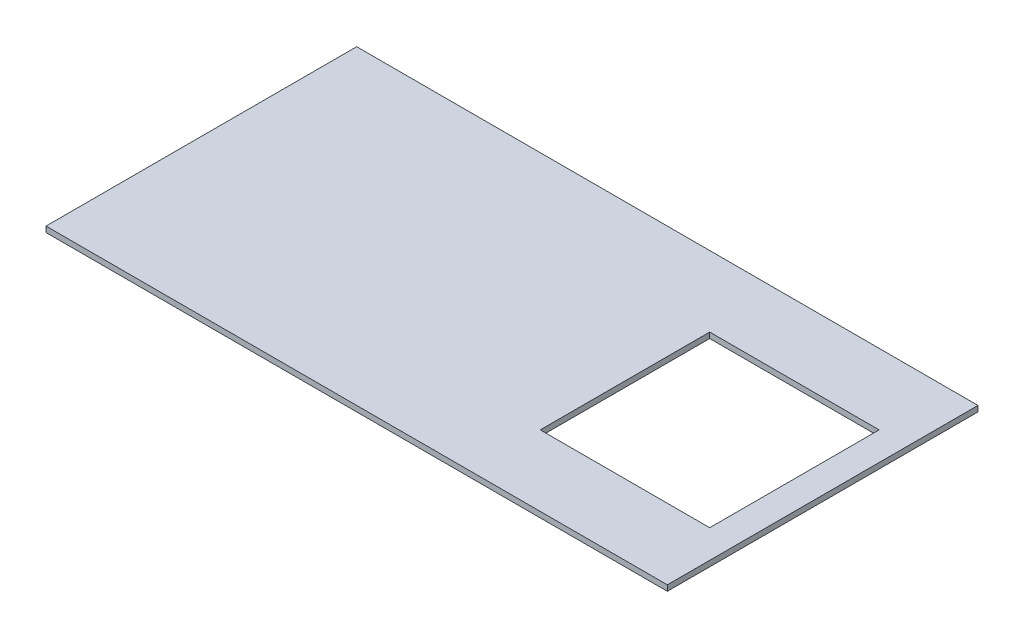
ISO-10303-21;
HEADER;
FILE_DESCRIPTION(('STEP AP214'),'2;1');
FILE_NAME('part.step','',(''),(''),'','','');
FILE_SCHEMA(('AUTOMOTIVE_DESIGN { 1 0 10303 214 1 1 1 1 }'));
ENDSEC;
DATA;
#1=APPLICATION_CONTEXT('core data for automotive mechanical design processes');
#2=APPLICATION_PROTOCOL_DEFINITION('international standard','automotive_design',2000,#1);
#3=PRODUCT_CONTEXT('',#1,'mechanical');
#4=PRODUCT('Part','Part','',(#3));
#5=PRODUCT_RELATED_PRODUCT_CATEGORY('part','',(#4));
#6=PRODUCT_DEFINITION_FORMATION('','',#4);
#7=PRODUCT_DEFINITION_CONTEXT('part definition',#1,'design');
#8=PRODUCT_DEFINITION('design','',#6,#7);
#9=PRODUCT_DEFINITION_SHAPE('','',#8);
#10=(LENGTH_UNIT() NAMED_UNIT(*) SI_UNIT(.MILLI.,.METRE.));
#11=(NAMED_UNIT(*) PLANE_ANGLE_UNIT() SI_UNIT($,.RADIAN.));
#12=(NAMED_UNIT(*) SI_UNIT($,.STERADIAN.) SOLID_ANGLE_UNIT());
#13=UNCERTAINTY_MEASURE_WITH_UNIT(LENGTH_MEASURE(1.E-05),#10,'distance_accuracy_value','');
#14=(GEOMETRIC_REPRESENTATION_CONTEXT(3) GLOBAL_UNCERTAINTY_ASSIGNED_CONTEXT((#13)) GLOBAL_UNIT_ASSIGNED_CONTEXT((#10,
#11,#12)) REPRESENTATION_CONTEXT('',''));
#15=CARTESIAN_POINT('',(0.,0.,0.));
#16=DIRECTION('',(0.,0.,1.));
#17=DIRECTION('',(1.,0.,0.));
#18=AXIS2_PLACEMENT_3D('',#15,#16,#17);
#19=CARTESIAN_POINT('',(0.,20.,0.));
#20=DIRECTION('',(1.,0.,0.));
#21=DIRECTION('',(0.,0.,-1.));
#22=AXIS2_PLACEMENT_3D('',#19,#20,#21);
#23=PLANE('',#22);
#24=DIRECTION('',(0.,0.,1.));
#25=VECTOR('',#24,1.);
#26=CARTESIAN_POINT('',(0.,0.,0.));
#27=LINE('',#26,#25);
#28=CARTESIAN_POINT('',(0.,0.,-1100.));
#29=VERTEX_POINT('',#28);
#30=CARTESIAN_POINT('',(0.,0.,0.));
#31=VERTEX_POINT('',#30);
#32=EDGE_CURVE('E128',#29,#31,#27,.T.);
#33=ORIENTED_EDGE('',*,*,#32,.T.);
#34=DIRECTION('',(0.,-1.,0.));
#35=VECTOR('',#34,1.);
#36=CARTESIAN_POINT('',(0.,20.,0.));
#37=LINE('',#36,#35);
#38=CARTESIAN_POINT('',(0.,20.,0.));
#39=VERTEX_POINT('',#38);
#40=EDGE_CURVE('E11',#39,#31,#37,.T.);
#41=ORIENTED_EDGE('',*,*,#40,.F.);
#42=DIRECTION('',(0.,0.,1.));
#43=VECTOR('',#42,1.);
#44=CARTESIAN_POINT('',(0.,20.,0.));
#45=LINE('',#44,#43);
#46=CARTESIAN_POINT('',(0.,20.,-1100.));
#47=VERTEX_POINT('',#46);
#48=EDGE_CURVE('E139',#47,#39,#45,.T.);
#49=ORIENTED_EDGE('',*,*,#48,.F.);
#50=DIRECTION('',(0.,-1.,0.));
#51=VECTOR('',#50,1.);
#52=CARTESIAN_POINT('',(0.,20.,-1100.));
#53=LINE('',#52,#51);
#54=EDGE_CURVE('E148',#47,#29,#53,.T.);
#55=ORIENTED_EDGE('',*,*,#54,.T.);
#56=EDGE_LOOP('',(#33,#41,#49,#55));
#57=FACE_BOUND('',#56,.T.);
#58=ADVANCED_FACE('F30',(#57),#23,.F.);
#59=CARTESIAN_POINT('',(0.,20.,0.));
#60=DIRECTION('',(0.,0.,-1.));
#61=DIRECTION('',(-1.,0.,0.));
#62=AXIS2_PLACEMENT_3D('',#59,#60,#61);
#63=PLANE('',#62);
#64=DIRECTION('',(1.,0.,0.));
#65=VECTOR('',#64,1.);
#66=CARTESIAN_POINT('',(0.,0.,0.));
#67=LINE('',#66,#65);
#68=CARTESIAN_POINT('',(2200.,0.,0.));
#69=VERTEX_POINT('',#68);
#70=EDGE_CURVE('E133',#31,#69,#67,.T.);
#71=ORIENTED_EDGE('',*,*,#70,.T.);
#72=DIRECTION('',(0.,-1.,0.));
#73=VECTOR('',#72,1.);
#74=CARTESIAN_POINT('',(2200.,20.,0.));
#75=LINE('',#74,#73);
#76=CARTESIAN_POINT('',(2200.,20.,0.));
#77=VERTEX_POINT('',#76);
#78=EDGE_CURVE('E37',#77,#69,#75,.T.);
#79=ORIENTED_EDGE('',*,*,#78,.F.);
#80=DIRECTION('',(1.,0.,0.));
#81=VECTOR('',#80,1.);
#82=CARTESIAN_POINT('',(0.,20.,0.));
#83=LINE('',#82,#81);
#84=EDGE_CURVE('E142',#39,#77,#83,.T.);
#85=ORIENTED_EDGE('',*,*,#84,.F.);
#86=ORIENTED_EDGE('',*,*,#40,.T.);
#87=EDGE_LOOP('',(#71,#79,#85,#86));
#88=FACE_BOUND('',#87,.T.);
#89=ADVANCED_FACE('F172',(#88),#63,.F.);
#90=CARTESIAN_POINT('',(2200.,20.,0.));
#91=DIRECTION('',(-1.,0.,0.));
#92=DIRECTION('',(0.,0.,1.));
#93=AXIS2_PLACEMENT_3D('',#90,#91,#92);
#94=PLANE('',#93);
#95=DIRECTION('',(0.,0.,-1.));
#96=VECTOR('',#95,1.);
#97=CARTESIAN_POINT('',(2200.,0.,0.));
#98=LINE('',#97,#96);
#99=CARTESIAN_POINT('',(2200.,0.,-1100.));
#100=VERTEX_POINT('',#99);
#101=EDGE_CURVE('E135',#69,#100,#98,.T.);
#102=ORIENTED_EDGE('',*,*,#101,.T.);
#103=DIRECTION('',(0.,-1.,0.));
#104=VECTOR('',#103,1.);
#105=CARTESIAN_POINT('',(2200.,20.,-1100.));
#106=LINE('',#105,#104);
#107=CARTESIAN_POINT('',(2200.,20.,-1100.));
#108=VERTEX_POINT('',#107);
#109=EDGE_CURVE('E151',#108,#100,#106,.T.);
#110=ORIENTED_EDGE('',*,*,#109,.F.);
#111=DIRECTION('',(0.,0.,-1.));
#112=VECTOR('',#111,1.);
#113=CARTESIAN_POINT('',(2200.,20.,0.));
#114=LINE('',#113,#112);
#115=EDGE_CURVE('E144',#77,#108,#114,.T.);
#116=ORIENTED_EDGE('',*,*,#115,.F.);
#117=ORIENTED_EDGE('',*,*,#78,.T.);
#118=EDGE_LOOP('',(#102,#110,#116,#117));
#119=FACE_BOUND('',#118,.T.);
#120=ADVANCED_FACE('F158',(#119),#94,.F.);
#121=CARTESIAN_POINT('',(0.,20.,-1100.));
#122=DIRECTION('',(0.,0.,1.));
#123=DIRECTION('',(1.,0.,0.));
#124=AXIS2_PLACEMENT_3D('',#121,#122,#123);
#125=PLANE('',#124);
#126=DIRECTION('',(-1.,0.,0.));
#127=VECTOR('',#126,1.);
#128=CARTESIAN_POINT('',(0.,0.,-1100.));
#129=LINE('',#128,#127);
#130=EDGE_CURVE('E137',#100,#29,#129,.T.);
#131=ORIENTED_EDGE('',*,*,#130,.T.);
#132=ORIENTED_EDGE('',*,*,#54,.F.);
#133=DIRECTION('',(-1.,0.,0.));
#134=VECTOR('',#133,1.);
#135=CARTESIAN_POINT('',(0.,20.,-1100.));
#136=LINE('',#135,#134);
#137=EDGE_CURVE('E146',#108,#47,#136,.T.);
#138=ORIENTED_EDGE('',*,*,#137,.F.);
#139=ORIENTED_EDGE('',*,*,#109,.T.);
#140=EDGE_LOOP('',(#131,#132,#138,#139));
#141=FACE_BOUND('',#140,.T.);
#142=ADVANCED_FACE('F167',(#141),#125,.F.);
#143=CARTESIAN_POINT('',(0.,20.,-1100.));
#144=DIRECTION('',(0.,-1.,0.));
#145=DIRECTION('',(0.,0.,-1.));
#146=AXIS2_PLACEMENT_3D('',#143,#144,#145);
#147=PLANE('',#146);
#148=DIRECTION('',(1.,0.,0.));
#149=VECTOR('',#148,1.);
#150=CARTESIAN_POINT('',(1500.,20.,-250.));
#151=LINE('',#150,#149);
#152=CARTESIAN_POINT('',(1500.,20.,-250.));
#153=VERTEX_POINT('',#152);
#154=CARTESIAN_POINT('',(2100.,20.,-250.));
#155=VERTEX_POINT('',#154);
#156=EDGE_CURVE('E105',#153,#155,#151,.T.);
#157=ORIENTED_EDGE('',*,*,#156,.F.);
#158=DIRECTION('',(0.,0.,1.));
#159=VECTOR('',#158,1.);
#160=CARTESIAN_POINT('',(1500.,20.,-850.));
#161=LINE('',#160,#159);
#162=CARTESIAN_POINT('',(1500.,20.,-850.));
#163=VERTEX_POINT('',#162);
#164=EDGE_CURVE('E44',#163,#153,#161,.T.);
#165=ORIENTED_EDGE('',*,*,#164,.F.);
#166=DIRECTION('',(-1.,0.,0.));
#167=VECTOR('',#166,1.);
#168=CARTESIAN_POINT('',(1500.,20.,-850.));
#169=LINE('',#168,#167);
#170=CARTESIAN_POINT('',(2100.,20.,-850.));
#171=VERTEX_POINT('',#170);
#172=EDGE_CURVE('E112',#171,#163,#169,.T.);
#173=ORIENTED_EDGE('',*,*,#172,.F.);
#174=DIRECTION('',(0.,0.,-1.));
#175=VECTOR('',#174,1.);
#176=CARTESIAN_POINT('',(2100.,20.,-850.));
#177=LINE('',#176,#175);
#178=EDGE_CURVE('E96',#155,#171,#177,.T.);
#179=ORIENTED_EDGE('',*,*,#178,.F.);
#180=EDGE_LOOP('',(#157,#165,#173,#179));
#181=FACE_BOUND('',#180,.T.);
#182=ORIENTED_EDGE('',*,*,#48,.T.);
#183=ORIENTED_EDGE('',*,*,#84,.T.);
#184=ORIENTED_EDGE('',*,*,#115,.T.);
#185=ORIENTED_EDGE('',*,*,#137,.T.);
#186=EDGE_LOOP('',(#182,#183,#184,#185));
#187=FACE_BOUND('',#186,.T.);
#188=ADVANCED_FACE('F109',(#181,#187),#147,.F.);
#189=CARTESIAN_POINT('',(0.,0.,-1100.));
#190=DIRECTION('',(0.,-1.,0.));
#191=DIRECTION('',(0.,0.,-1.));
#192=AXIS2_PLACEMENT_3D('',#189,#190,#191);
#193=PLANE('',#192);
#194=DIRECTION('',(0.,0.,1.));
#195=VECTOR('',#194,1.);
#196=CARTESIAN_POINT('',(1500.,0.,-850.));
#197=LINE('',#196,#195);
#198=CARTESIAN_POINT('',(1500.,0.,-850.));
#199=VERTEX_POINT('',#198);
#200=CARTESIAN_POINT('',(1500.,0.,-250.));
#201=VERTEX_POINT('',#200);
#202=EDGE_CURVE('E114',#199,#201,#197,.T.);
#203=ORIENTED_EDGE('',*,*,#202,.T.);
#204=DIRECTION('',(1.,0.,0.));
#205=VECTOR('',#204,1.);
#206=CARTESIAN_POINT('',(1500.,0.,-250.));
#207=LINE('',#206,#205);
#208=CARTESIAN_POINT('',(2100.,0.,-250.));
#209=VERTEX_POINT('',#208);
#210=EDGE_CURVE('E120',#201,#209,#207,.T.);
#211=ORIENTED_EDGE('',*,*,#210,.T.);
#212=DIRECTION('',(0.,0.,-1.));
#213=VECTOR('',#212,1.);
#214=CARTESIAN_POINT('',(2100.,0.,-850.));
#215=LINE('',#214,#213);
#216=CARTESIAN_POINT('',(2100.,0.,-850.));
#217=VERTEX_POINT('',#216);
#218=EDGE_CURVE('E52',#209,#217,#215,.T.);
#219=ORIENTED_EDGE('',*,*,#218,.T.);
#220=DIRECTION('',(-1.,0.,0.));
#221=VECTOR('',#220,1.);
#222=CARTESIAN_POINT('',(1500.,0.,-850.));
#223=LINE('',#222,#221);
#224=EDGE_CURVE('E123',#217,#199,#223,.T.);
#225=ORIENTED_EDGE('',*,*,#224,.T.);
#226=EDGE_LOOP('',(#203,#211,#219,#225));
#227=FACE_BOUND('',#226,.T.);
#228=ORIENTED_EDGE('',*,*,#32,.F.);
#229=ORIENTED_EDGE('',*,*,#130,.F.);
#230=ORIENTED_EDGE('',*,*,#101,.F.);
#231=ORIENTED_EDGE('',*,*,#70,.F.);
#232=EDGE_LOOP('',(#228,#229,#230,#231));
#233=FACE_BOUND('',#232,.T.);
#234=ADVANCED_FACE('F164',(#227,#233),#193,.T.);
#235=CARTESIAN_POINT('',(1500.,0.,-850.));
#236=DIRECTION('',(-1.,0.,0.));
#237=DIRECTION('',(0.,0.,1.));
#238=AXIS2_PLACEMENT_3D('',#235,#236,#237);
#239=PLANE('',#238);
#240=ORIENTED_EDGE('',*,*,#164,.T.);
#241=DIRECTION('',(0.,1.,0.));
#242=VECTOR('',#241,1.);
#243=CARTESIAN_POINT('',(1500.,0.,-250.));
#244=LINE('',#243,#242);
#245=EDGE_CURVE('E102',#201,#153,#244,.T.);
#246=ORIENTED_EDGE('',*,*,#245,.F.);
#247=ORIENTED_EDGE('',*,*,#202,.F.);
#248=DIRECTION('',(0.,1.,0.));
#249=VECTOR('',#248,1.);
#250=CARTESIAN_POINT('',(1500.,0.,-850.));
#251=LINE('',#250,#249);
#252=EDGE_CURVE('E126',#199,#163,#251,.T.);
#253=ORIENTED_EDGE('',*,*,#252,.T.);
#254=EDGE_LOOP('',(#240,#246,#247,#253));
#255=FACE_BOUND('',#254,.T.);
#256=ADVANCED_FACE('F186',(#255),#239,.F.);
#257=CARTESIAN_POINT('',(1500.,0.,-850.));
#258=DIRECTION('',(0.,0.,-1.));
#259=DIRECTION('',(-1.,0.,0.));
#260=AXIS2_PLACEMENT_3D('',#257,#258,#259);
#261=PLANE('',#260);
#262=ORIENTED_EDGE('',*,*,#172,.T.);
#263=ORIENTED_EDGE('',*,*,#252,.F.);
#264=ORIENTED_EDGE('',*,*,#224,.F.);
#265=DIRECTION('',(0.,1.,0.));
#266=VECTOR('',#265,1.);
#267=CARTESIAN_POINT('',(2100.,0.,-850.));
#268=LINE('',#267,#266);
#269=EDGE_CURVE('E101',#217,#171,#268,.T.);
#270=ORIENTED_EDGE('',*,*,#269,.T.);
#271=EDGE_LOOP('',(#262,#263,#264,#270));
#272=FACE_BOUND('',#271,.T.);
#273=ADVANCED_FACE('F190',(#272),#261,.F.);
#274=CARTESIAN_POINT('',(2100.,0.,-850.));
#275=DIRECTION('',(1.,0.,0.));
#276=DIRECTION('',(0.,0.,-1.));
#277=AXIS2_PLACEMENT_3D('',#274,#275,#276);
#278=PLANE('',#277);
#279=ORIENTED_EDGE('',*,*,#178,.T.);
#280=ORIENTED_EDGE('',*,*,#269,.F.);
#281=ORIENTED_EDGE('',*,*,#218,.F.);
#282=DIRECTION('',(0.,1.,0.));
#283=VECTOR('',#282,1.);
#284=CARTESIAN_POINT('',(2100.,0.,-250.));
#285=LINE('',#284,#283);
#286=EDGE_CURVE('E92',#209,#155,#285,.T.);
#287=ORIENTED_EDGE('',*,*,#286,.T.);
#288=EDGE_LOOP('',(#279,#280,#281,#287));
#289=FACE_BOUND('',#288,.T.);
#290=ADVANCED_FACE('F94',(#289),#278,.F.);
#291=CARTESIAN_POINT('',(1500.,0.,-250.));
#292=DIRECTION('',(0.,0.,1.));
#293=DIRECTION('',(1.,0.,0.));
#294=AXIS2_PLACEMENT_3D('',#291,#292,#293);
#295=PLANE('',#294);
#296=ORIENTED_EDGE('',*,*,#156,.T.);
#297=ORIENTED_EDGE('',*,*,#286,.F.);
#298=ORIENTED_EDGE('',*,*,#210,.F.);
#299=ORIENTED_EDGE('',*,*,#245,.T.);
#300=EDGE_LOOP('',(#296,#297,#298,#299));
#301=FACE_BOUND('',#300,.T.);
#302=ADVANCED_FACE('F106',(#301),#295,.F.);
#303=CLOSED_SHELL('',(#58,#89,#120,#142,#188,#234,#256,#273,#290,#302));
#304=MANIFOLD_SOLID_BREP('B2',#303);
#305=ADVANCED_BREP_SHAPE_REPRESENTATION('',(#18,#304),#14);
#306=SHAPE_DEFINITION_REPRESENTATION(#9,#305);
ENDSEC;
END-ISO-10303-21;
